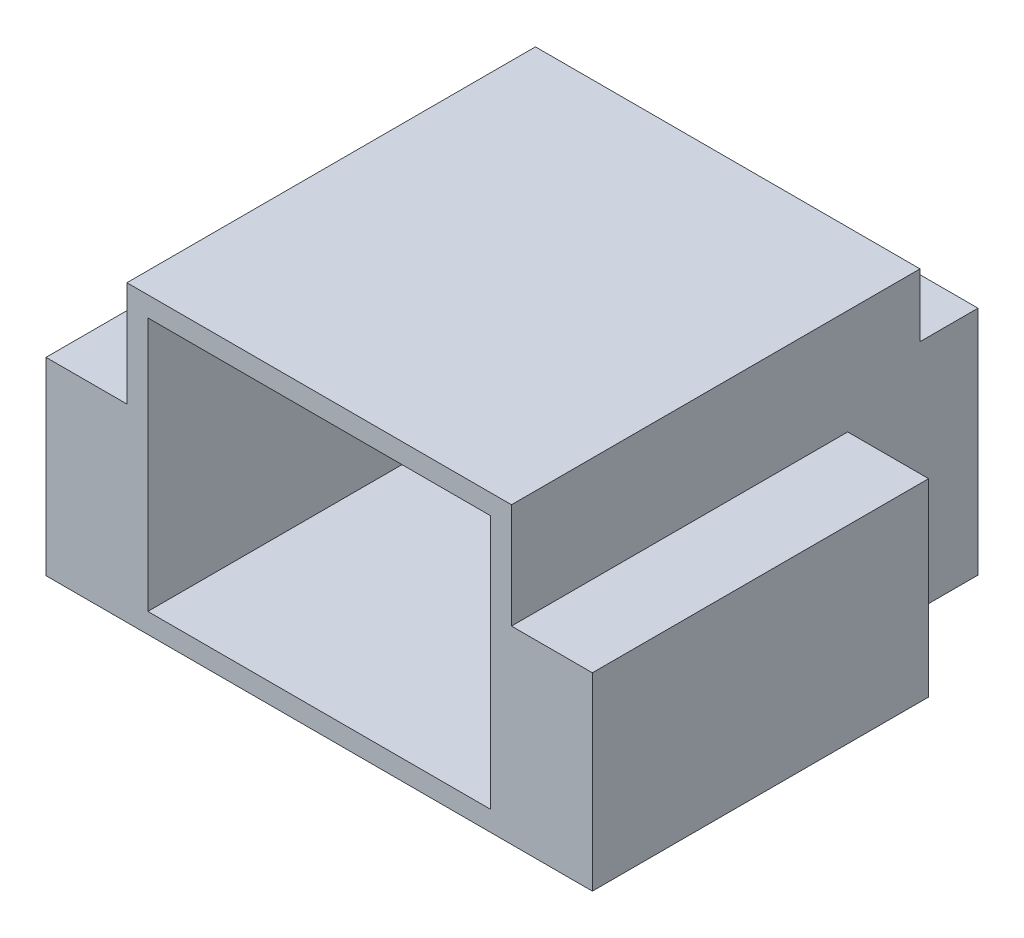
ISO-10303-21;
HEADER;
FILE_DESCRIPTION(('STEP AP214'),'2;1');
FILE_NAME('part.step','',(''),(''),'','','');
FILE_SCHEMA(('AUTOMOTIVE_DESIGN { 1 0 10303 214 1 1 1 1 }'));
ENDSEC;
DATA;
#1=APPLICATION_CONTEXT('core data for automotive mechanical design processes');
#2=APPLICATION_PROTOCOL_DEFINITION('international standard','automotive_design',2000,#1);
#3=PRODUCT_CONTEXT('',#1,'mechanical');
#4=PRODUCT('Part','Part','',(#3));
#5=PRODUCT_RELATED_PRODUCT_CATEGORY('part','',(#4));
#6=PRODUCT_DEFINITION_FORMATION('','',#4);
#7=PRODUCT_DEFINITION_CONTEXT('part definition',#1,'design');
#8=PRODUCT_DEFINITION('design','',#6,#7);
#9=PRODUCT_DEFINITION_SHAPE('','',#8);
#10=(LENGTH_UNIT() NAMED_UNIT(*) SI_UNIT(.MILLI.,.METRE.));
#11=(NAMED_UNIT(*) PLANE_ANGLE_UNIT() SI_UNIT($,.RADIAN.));
#12=(NAMED_UNIT(*) SI_UNIT($,.STERADIAN.) SOLID_ANGLE_UNIT());
#13=UNCERTAINTY_MEASURE_WITH_UNIT(LENGTH_MEASURE(1.E-05),#10,'distance_accuracy_value','');
#14=(GEOMETRIC_REPRESENTATION_CONTEXT(3) GLOBAL_UNCERTAINTY_ASSIGNED_CONTEXT((#13)) GLOBAL_UNIT_ASSIGNED_CONTEXT((#10,
#11,#12)) REPRESENTATION_CONTEXT('',''));
#15=CARTESIAN_POINT('',(0.,0.,0.));
#16=DIRECTION('',(0.,0.,1.));
#17=DIRECTION('',(1.,0.,0.));
#18=AXIS2_PLACEMENT_3D('',#15,#16,#17);
#19=CARTESIAN_POINT('',(0.,7.,-7.1));
#20=DIRECTION('',(0.,0.,-1.));
#21=DIRECTION('',(-1.,0.,0.));
#22=AXIS2_PLACEMENT_3D('',#19,#20,#21);
#23=PLANE('',#22);
#24=DIRECTION('',(0.,-1.,0.));
#25=VECTOR('',#24,1.);
#26=CARTESIAN_POINT('',(-4.575,7.,-7.1));
#27=LINE('',#26,#25);
#28=CARTESIAN_POINT('',(-4.575,5.5,-7.1));
#29=VERTEX_POINT('',#28);
#30=CARTESIAN_POINT('',(-4.575,0.,-7.1));
#31=VERTEX_POINT('',#30);
#32=EDGE_CURVE('E238',#29,#31,#27,.T.);
#33=ORIENTED_EDGE('',*,*,#32,.F.);
#34=DIRECTION('',(-1.,0.,0.));
#35=VECTOR('',#34,1.);
#36=CARTESIAN_POINT('',(-4.575,5.5,-7.1));
#37=LINE('',#36,#35);
#38=CARTESIAN_POINT('',(4.575,5.5,-7.1));
#39=VERTEX_POINT('',#38);
#40=EDGE_CURVE('E195',#39,#29,#37,.T.);
#41=ORIENTED_EDGE('',*,*,#40,.F.);
#42=DIRECTION('',(0.,-1.,0.));
#43=VECTOR('',#42,1.);
#44=CARTESIAN_POINT('',(4.575,7.,-7.1));
#45=LINE('',#44,#43);
#46=CARTESIAN_POINT('',(4.575,0.,-7.1));
#47=VERTEX_POINT('',#46);
#48=EDGE_CURVE('E260',#39,#47,#45,.T.);
#49=ORIENTED_EDGE('',*,*,#48,.T.);
#50=DIRECTION('',(1.,0.,0.));
#51=VECTOR('',#50,1.);
#52=CARTESIAN_POINT('',(0.,0.,-7.1));
#53=LINE('',#52,#51);
#54=EDGE_CURVE('E232',#31,#47,#53,.T.);
#55=ORIENTED_EDGE('',*,*,#54,.F.);
#56=EDGE_LOOP('',(#33,#41,#49,#55));
#57=FACE_BOUND('',#56,.T.);
#58=ADVANCED_FACE('F37',(#57),#23,.T.);
#59=CARTESIAN_POINT('',(6.5,7.,0.));
#60=DIRECTION('',(-1.,0.,0.));
#61=DIRECTION('',(0.,0.,1.));
#62=AXIS2_PLACEMENT_3D('',#59,#60,#61);
#63=PLANE('',#62);
#64=DIRECTION('',(0.,0.,-1.));
#65=VECTOR('',#64,1.);
#66=CARTESIAN_POINT('',(6.5,4.5,-4.));
#67=LINE('',#66,#65);
#68=CARTESIAN_POINT('',(6.5,4.5,4.));
#69=VERTEX_POINT('',#68);
#70=CARTESIAN_POINT('',(6.5,4.5,-4.));
#71=VERTEX_POINT('',#70);
#72=EDGE_CURVE('E221',#69,#71,#67,.T.);
#73=ORIENTED_EDGE('',*,*,#72,.F.);
#74=DIRECTION('',(0.,-1.,0.));
#75=VECTOR('',#74,1.);
#76=CARTESIAN_POINT('',(6.5,7.,4.));
#77=LINE('',#76,#75);
#78=CARTESIAN_POINT('',(6.5,0.,4.));
#79=VERTEX_POINT('',#78);
#80=EDGE_CURVE('E266',#69,#79,#77,.T.);
#81=ORIENTED_EDGE('',*,*,#80,.T.);
#82=DIRECTION('',(0.,0.,-1.));
#83=VECTOR('',#82,1.);
#84=CARTESIAN_POINT('',(6.5,0.,0.));
#85=LINE('',#84,#83);
#86=CARTESIAN_POINT('',(6.5,0.,-4.));
#87=VERTEX_POINT('',#86);
#88=EDGE_CURVE('E251',#79,#87,#85,.T.);
#89=ORIENTED_EDGE('',*,*,#88,.T.);
#90=DIRECTION('',(0.,-1.,0.));
#91=VECTOR('',#90,1.);
#92=CARTESIAN_POINT('',(6.5,7.,-4.));
#93=LINE('',#92,#91);
#94=EDGE_CURVE('E264',#71,#87,#93,.T.);
#95=ORIENTED_EDGE('',*,*,#94,.F.);
#96=EDGE_LOOP('',(#73,#81,#89,#95));
#97=FACE_BOUND('',#96,.T.);
#98=ADVANCED_FACE('F314',(#97),#63,.F.);
#99=CARTESIAN_POINT('',(0.,7.,-4.));
#100=DIRECTION('',(0.,0.,-1.));
#101=DIRECTION('',(-1.,0.,0.));
#102=AXIS2_PLACEMENT_3D('',#99,#100,#101);
#103=PLANE('',#102);
#104=DIRECTION('',(0.,-1.,0.));
#105=VECTOR('',#104,1.);
#106=CARTESIAN_POINT('',(4.575,7.,-4.));
#107=LINE('',#106,#105);
#108=CARTESIAN_POINT('',(4.575,4.5,-4.));
#109=VERTEX_POINT('',#108);
#110=CARTESIAN_POINT('',(4.575,0.,-4.));
#111=VERTEX_POINT('',#110);
#112=EDGE_CURVE('E262',#109,#111,#107,.T.);
#113=ORIENTED_EDGE('',*,*,#112,.F.);
#114=DIRECTION('',(-1.,0.,0.));
#115=VECTOR('',#114,1.);
#116=CARTESIAN_POINT('',(4.575,4.5,-4.));
#117=LINE('',#116,#115);
#118=EDGE_CURVE('E223',#71,#109,#117,.T.);
#119=ORIENTED_EDGE('',*,*,#118,.F.);
#120=ORIENTED_EDGE('',*,*,#94,.T.);
#121=DIRECTION('',(1.,0.,0.));
#122=VECTOR('',#121,1.);
#123=CARTESIAN_POINT('',(0.,0.,-4.));
#124=LINE('',#123,#122);
#125=EDGE_CURVE('E245',#111,#87,#124,.T.);
#126=ORIENTED_EDGE('',*,*,#125,.F.);
#127=EDGE_LOOP('',(#113,#119,#120,#126));
#128=FACE_BOUND('',#127,.T.);
#129=ADVANCED_FACE('F309',(#128),#103,.T.);
#130=CARTESIAN_POINT('',(-4.575,7.,0.));
#131=DIRECTION('',(-1.,0.,0.));
#132=DIRECTION('',(0.,0.,1.));
#133=AXIS2_PLACEMENT_3D('',#130,#131,#132);
#134=PLANE('',#133);
#135=DIRECTION('',(0.,1.,0.));
#136=VECTOR('',#135,1.);
#137=CARTESIAN_POINT('',(-4.575,5.5,-5.72056539600396));
#138=LINE('',#137,#136);
#139=CARTESIAN_POINT('',(-4.575,5.5,-5.72056539600396));
#140=VERTEX_POINT('',#139);
#141=CARTESIAN_POINT('',(-4.575,7.,-5.72056539600396));
#142=VERTEX_POINT('',#141);
#143=EDGE_CURVE('E60',#140,#142,#138,.T.);
#144=ORIENTED_EDGE('',*,*,#143,.F.);
#145=DIRECTION('',(0.,0.,1.));
#146=VECTOR('',#145,1.);
#147=CARTESIAN_POINT('',(-4.575,5.5,-7.1));
#148=LINE('',#147,#146);
#149=EDGE_CURVE('E187',#29,#140,#148,.T.);
#150=ORIENTED_EDGE('',*,*,#149,.F.);
#151=ORIENTED_EDGE('',*,*,#32,.T.);
#152=DIRECTION('',(0.,0.,-1.));
#153=VECTOR('',#152,1.);
#154=CARTESIAN_POINT('',(-4.575,0.,0.));
#155=LINE('',#154,#153);
#156=CARTESIAN_POINT('',(-4.575,0.,-4.));
#157=VERTEX_POINT('',#156);
#158=EDGE_CURVE('E216',#157,#31,#155,.T.);
#159=ORIENTED_EDGE('',*,*,#158,.F.);
#160=DIRECTION('',(0.,-1.,0.));
#161=VECTOR('',#160,1.);
#162=CARTESIAN_POINT('',(-4.575,7.,-4.));
#163=LINE('',#162,#161);
#164=CARTESIAN_POINT('',(-4.575,4.5,-4.));
#165=VERTEX_POINT('',#164);
#166=EDGE_CURVE('E11',#165,#157,#163,.T.);
#167=ORIENTED_EDGE('',*,*,#166,.F.);
#168=DIRECTION('',(0.,0.,-1.));
#169=VECTOR('',#168,1.);
#170=CARTESIAN_POINT('',(-4.575,4.5,-4.));
#171=LINE('',#170,#169);
#172=CARTESIAN_POINT('',(-4.575,4.5,4.));
#173=VERTEX_POINT('',#172);
#174=EDGE_CURVE('E203',#173,#165,#171,.T.);
#175=ORIENTED_EDGE('',*,*,#174,.F.);
#176=DIRECTION('',(0.,1.,0.));
#177=VECTOR('',#176,1.);
#178=CARTESIAN_POINT('',(-4.575,4.5,4.));
#179=LINE('',#178,#177);
#180=CARTESIAN_POINT('',(-4.575,7.,4.));
#181=VERTEX_POINT('',#180);
#182=EDGE_CURVE('E213',#173,#181,#179,.T.);
#183=ORIENTED_EDGE('',*,*,#182,.T.);
#184=DIRECTION('',(0.,0.,-1.));
#185=VECTOR('',#184,1.);
#186=CARTESIAN_POINT('',(-4.575,7.,0.));
#187=LINE('',#186,#185);
#188=EDGE_CURVE('E228',#181,#142,#187,.T.);
#189=ORIENTED_EDGE('',*,*,#188,.T.);
#190=EDGE_LOOP('',(#144,#150,#151,#159,#167,#175,#183,#189));
#191=FACE_BOUND('',#190,.T.);
#192=ADVANCED_FACE('F39',(#191),#134,.T.);
#193=DIRECTION('',(-1.,0.,0.));
#194=VECTOR('',#193,1.);
#195=CARTESIAN_POINT('',(-4.575,4.5,-4.));
#196=LINE('',#195,#194);
#197=CARTESIAN_POINT('',(-6.5,4.5,-4.));
#198=VERTEX_POINT('',#197);
#199=EDGE_CURVE('E205',#165,#198,#196,.T.);
#200=ORIENTED_EDGE('',*,*,#199,.F.);
#201=ORIENTED_EDGE('',*,*,#166,.T.);
#202=CARTESIAN_POINT('',(-6.5,0.,-4.));
#203=VERTEX_POINT('',#202);
#204=EDGE_CURVE('E241',#203,#157,#124,.T.);
#205=ORIENTED_EDGE('',*,*,#204,.F.);
#206=DIRECTION('',(0.,-1.,0.));
#207=VECTOR('',#206,1.);
#208=CARTESIAN_POINT('',(-6.5,7.,-4.));
#209=LINE('',#208,#207);
#210=EDGE_CURVE('E45',#198,#203,#209,.T.);
#211=ORIENTED_EDGE('',*,*,#210,.F.);
#212=EDGE_LOOP('',(#200,#201,#205,#211));
#213=FACE_BOUND('',#212,.T.);
#214=ADVANCED_FACE('F278',(#213),#103,.T.);
#215=CARTESIAN_POINT('',(-6.5,7.,0.));
#216=DIRECTION('',(-1.,0.,0.));
#217=DIRECTION('',(0.,0.,1.));
#218=AXIS2_PLACEMENT_3D('',#215,#216,#217);
#219=PLANE('',#218);
#220=DIRECTION('',(0.,0.,1.));
#221=VECTOR('',#220,1.);
#222=CARTESIAN_POINT('',(-6.5,4.5,-4.));
#223=LINE('',#222,#221);
#224=CARTESIAN_POINT('',(-6.5,4.5,4.));
#225=VERTEX_POINT('',#224);
#226=EDGE_CURVE('E208',#198,#225,#223,.T.);
#227=ORIENTED_EDGE('',*,*,#226,.F.);
#228=ORIENTED_EDGE('',*,*,#210,.T.);
#229=DIRECTION('',(0.,0.,-1.));
#230=VECTOR('',#229,1.);
#231=CARTESIAN_POINT('',(-6.5,0.,0.));
#232=LINE('',#231,#230);
#233=CARTESIAN_POINT('',(-6.5,0.,4.));
#234=VERTEX_POINT('',#233);
#235=EDGE_CURVE('E244',#234,#203,#232,.T.);
#236=ORIENTED_EDGE('',*,*,#235,.F.);
#237=DIRECTION('',(0.,-1.,0.));
#238=VECTOR('',#237,1.);
#239=CARTESIAN_POINT('',(-6.5,7.,4.));
#240=LINE('',#239,#238);
#241=EDGE_CURVE('E268',#225,#234,#240,.T.);
#242=ORIENTED_EDGE('',*,*,#241,.F.);
#243=EDGE_LOOP('',(#227,#228,#236,#242));
#244=FACE_BOUND('',#243,.T.);
#245=ADVANCED_FACE('F274',(#244),#219,.T.);
#246=CARTESIAN_POINT('',(0.,7.,4.));
#247=DIRECTION('',(0.,0.,-1.));
#248=DIRECTION('',(-1.,0.,0.));
#249=AXIS2_PLACEMENT_3D('',#246,#247,#248);
#250=PLANE('',#249);
#251=DIRECTION('',(0.,1.,0.));
#252=VECTOR('',#251,1.);
#253=CARTESIAN_POINT('',(4.07761296072096,0.,4.));
#254=LINE('',#253,#252);
#255=CARTESIAN_POINT('',(4.07761296072096,0.475574495931823,4.));
#256=VERTEX_POINT('',#255);
#257=CARTESIAN_POINT('',(4.07761296072096,6.52442550406818,4.));
#258=VERTEX_POINT('',#257);
#259=EDGE_CURVE('E177',#256,#258,#254,.T.);
#260=ORIENTED_EDGE('',*,*,#259,.F.);
#261=DIRECTION('',(1.,0.,0.));
#262=VECTOR('',#261,1.);
#263=CARTESIAN_POINT('',(0.,0.475574495931823,4.));
#264=LINE('',#263,#262);
#265=CARTESIAN_POINT('',(-4.07761296072096,0.475574495931823,4.));
#266=VERTEX_POINT('',#265);
#267=EDGE_CURVE('E52',#266,#256,#264,.T.);
#268=ORIENTED_EDGE('',*,*,#267,.F.);
#269=DIRECTION('',(0.,1.,0.));
#270=VECTOR('',#269,1.);
#271=CARTESIAN_POINT('',(-4.07761296072096,0.,4.));
#272=LINE('',#271,#270);
#273=CARTESIAN_POINT('',(-4.07761296072096,6.52442550406818,4.));
#274=VERTEX_POINT('',#273);
#275=EDGE_CURVE('E168',#266,#274,#272,.T.);
#276=ORIENTED_EDGE('',*,*,#275,.T.);
#277=DIRECTION('',(1.,0.,0.));
#278=VECTOR('',#277,1.);
#279=CARTESIAN_POINT('',(0.,6.52442550406818,4.));
#280=LINE('',#279,#278);
#281=EDGE_CURVE('E171',#274,#258,#280,.T.);
#282=ORIENTED_EDGE('',*,*,#281,.T.);
#283=EDGE_LOOP('',(#260,#268,#276,#282));
#284=FACE_BOUND('',#283,.T.);
#285=DIRECTION('',(1.,0.,0.));
#286=VECTOR('',#285,1.);
#287=CARTESIAN_POINT('',(0.,7.,4.));
#288=LINE('',#287,#286);
#289=CARTESIAN_POINT('',(4.575,7.,4.));
#290=VERTEX_POINT('',#289);
#291=EDGE_CURVE('E231',#181,#290,#288,.T.);
#292=ORIENTED_EDGE('',*,*,#291,.F.);
#293=ORIENTED_EDGE('',*,*,#182,.F.);
#294=DIRECTION('',(1.,0.,0.));
#295=VECTOR('',#294,1.);
#296=CARTESIAN_POINT('',(-4.575,4.5,4.));
#297=LINE('',#296,#295);
#298=EDGE_CURVE('E210',#225,#173,#297,.T.);
#299=ORIENTED_EDGE('',*,*,#298,.F.);
#300=ORIENTED_EDGE('',*,*,#241,.T.);
#301=DIRECTION('',(1.,0.,0.));
#302=VECTOR('',#301,1.);
#303=CARTESIAN_POINT('',(0.,0.,4.));
#304=LINE('',#303,#302);
#305=EDGE_CURVE('E248',#234,#79,#304,.T.);
#306=ORIENTED_EDGE('',*,*,#305,.T.);
#307=ORIENTED_EDGE('',*,*,#80,.F.);
#308=DIRECTION('',(1.,0.,0.));
#309=VECTOR('',#308,1.);
#310=CARTESIAN_POINT('',(4.575,4.5,4.));
#311=LINE('',#310,#309);
#312=CARTESIAN_POINT('',(4.575,4.5,4.));
#313=VERTEX_POINT('',#312);
#314=EDGE_CURVE('E219',#313,#69,#311,.T.);
#315=ORIENTED_EDGE('',*,*,#314,.F.);
#316=DIRECTION('',(0.,1.,0.));
#317=VECTOR('',#316,1.);
#318=CARTESIAN_POINT('',(4.575,4.5,4.));
#319=LINE('',#318,#317);
#320=EDGE_CURVE('E206',#313,#290,#319,.T.);
#321=ORIENTED_EDGE('',*,*,#320,.T.);
#322=EDGE_LOOP('',(#292,#293,#299,#300,#306,#307,#315,#321));
#323=FACE_BOUND('',#322,.T.);
#324=ADVANCED_FACE('F289',(#284,#323),#250,.F.);
#325=CARTESIAN_POINT('',(4.575,7.,0.));
#326=DIRECTION('',(-1.,0.,0.));
#327=DIRECTION('',(0.,0.,1.));
#328=AXIS2_PLACEMENT_3D('',#325,#326,#327);
#329=PLANE('',#328);
#330=DIRECTION('',(0.,0.,-1.));
#331=VECTOR('',#330,1.);
#332=CARTESIAN_POINT('',(4.575,5.5,-7.1));
#333=LINE('',#332,#331);
#334=CARTESIAN_POINT('',(4.575,5.5,-5.72056539600396));
#335=VERTEX_POINT('',#334);
#336=EDGE_CURVE('E193',#335,#39,#333,.T.);
#337=ORIENTED_EDGE('',*,*,#336,.F.);
#338=DIRECTION('',(0.,1.,0.));
#339=VECTOR('',#338,1.);
#340=CARTESIAN_POINT('',(4.575,5.5,-5.72056539600396));
#341=LINE('',#340,#339);
#342=CARTESIAN_POINT('',(4.575,7.,-5.72056539600396));
#343=VERTEX_POINT('',#342);
#344=EDGE_CURVE('E198',#335,#343,#341,.T.);
#345=ORIENTED_EDGE('',*,*,#344,.T.);
#346=DIRECTION('',(0.,0.,-1.));
#347=VECTOR('',#346,1.);
#348=CARTESIAN_POINT('',(4.575,7.,0.));
#349=LINE('',#348,#347);
#350=EDGE_CURVE('E235',#290,#343,#349,.T.);
#351=ORIENTED_EDGE('',*,*,#350,.F.);
#352=ORIENTED_EDGE('',*,*,#320,.F.);
#353=DIRECTION('',(0.,0.,1.));
#354=VECTOR('',#353,1.);
#355=CARTESIAN_POINT('',(4.575,4.5,-4.));
#356=LINE('',#355,#354);
#357=EDGE_CURVE('E201',#109,#313,#356,.T.);
#358=ORIENTED_EDGE('',*,*,#357,.F.);
#359=ORIENTED_EDGE('',*,*,#112,.T.);
#360=DIRECTION('',(0.,0.,-1.));
#361=VECTOR('',#360,1.);
#362=CARTESIAN_POINT('',(4.575,0.,0.));
#363=LINE('',#362,#361);
#364=EDGE_CURVE('E254',#111,#47,#363,.T.);
#365=ORIENTED_EDGE('',*,*,#364,.T.);
#366=ORIENTED_EDGE('',*,*,#48,.F.);
#367=EDGE_LOOP('',(#337,#345,#351,#352,#358,#359,#365,#366));
#368=FACE_BOUND('',#367,.T.);
#369=ADVANCED_FACE('F305',(#368),#329,.F.);
#370=CARTESIAN_POINT('',(0.,7.,0.));
#371=DIRECTION('',(0.,1.,0.));
#372=DIRECTION('',(0.,0.,1.));
#373=AXIS2_PLACEMENT_3D('',#370,#371,#372);
#374=PLANE('',#373);
#375=DIRECTION('',(1.,0.,0.));
#376=VECTOR('',#375,1.);
#377=CARTESIAN_POINT('',(-4.575,7.,-5.72056539600396));
#378=LINE('',#377,#376);
#379=EDGE_CURVE('E183',#142,#343,#378,.T.);
#380=ORIENTED_EDGE('',*,*,#379,.F.);
#381=ORIENTED_EDGE('',*,*,#188,.F.);
#382=ORIENTED_EDGE('',*,*,#291,.T.);
#383=ORIENTED_EDGE('',*,*,#350,.T.);
#384=EDGE_LOOP('',(#380,#381,#382,#383));
#385=FACE_BOUND('',#384,.T.);
#386=ADVANCED_FACE('F318',(#385),#374,.T.);
#387=CARTESIAN_POINT('',(0.,0.,0.));
#388=DIRECTION('',(0.,1.,0.));
#389=DIRECTION('',(0.,0.,1.));
#390=AXIS2_PLACEMENT_3D('',#387,#388,#389);
#391=PLANE('',#390);
#392=ORIENTED_EDGE('',*,*,#158,.T.);
#393=ORIENTED_EDGE('',*,*,#54,.T.);
#394=ORIENTED_EDGE('',*,*,#364,.F.);
#395=ORIENTED_EDGE('',*,*,#125,.T.);
#396=ORIENTED_EDGE('',*,*,#88,.F.);
#397=ORIENTED_EDGE('',*,*,#305,.F.);
#398=ORIENTED_EDGE('',*,*,#235,.T.);
#399=ORIENTED_EDGE('',*,*,#204,.T.);
#400=EDGE_LOOP('',(#392,#393,#394,#395,#396,#397,#398,#399));
#401=FACE_BOUND('',#400,.T.);
#402=ADVANCED_FACE('F283',(#401),#391,.F.);
#403=CARTESIAN_POINT('',(0.,4.5,0.));
#404=DIRECTION('',(0.,1.,0.));
#405=DIRECTION('',(0.,0.,1.));
#406=AXIS2_PLACEMENT_3D('',#403,#404,#405);
#407=PLANE('',#406);
#408=ORIENTED_EDGE('',*,*,#357,.T.);
#409=ORIENTED_EDGE('',*,*,#314,.T.);
#410=ORIENTED_EDGE('',*,*,#72,.T.);
#411=ORIENTED_EDGE('',*,*,#118,.T.);
#412=EDGE_LOOP('',(#408,#409,#410,#411));
#413=FACE_BOUND('',#412,.T.);
#414=ADVANCED_FACE('F316',(#413),#407,.T.);
#415=CARTESIAN_POINT('',(0.,4.5,0.));
#416=DIRECTION('',(0.,-1.,0.));
#417=DIRECTION('',(0.,0.,-1.));
#418=AXIS2_PLACEMENT_3D('',#415,#416,#417);
#419=PLANE('',#418);
#420=ORIENTED_EDGE('',*,*,#174,.T.);
#421=ORIENTED_EDGE('',*,*,#199,.T.);
#422=ORIENTED_EDGE('',*,*,#226,.T.);
#423=ORIENTED_EDGE('',*,*,#298,.T.);
#424=EDGE_LOOP('',(#420,#421,#422,#423));
#425=FACE_BOUND('',#424,.T.);
#426=ADVANCED_FACE('F294',(#425),#419,.F.);
#427=CARTESIAN_POINT('',(-4.575,5.5,-5.72056539600396));
#428=DIRECTION('',(0.,0.,1.));
#429=DIRECTION('',(1.,0.,0.));
#430=AXIS2_PLACEMENT_3D('',#427,#428,#429);
#431=PLANE('',#430);
#432=ORIENTED_EDGE('',*,*,#379,.T.);
#433=ORIENTED_EDGE('',*,*,#344,.F.);
#434=DIRECTION('',(1.,0.,0.));
#435=VECTOR('',#434,1.);
#436=CARTESIAN_POINT('',(-4.575,5.5,-5.72056539600396));
#437=LINE('',#436,#435);
#438=EDGE_CURVE('E190',#140,#335,#437,.T.);
#439=ORIENTED_EDGE('',*,*,#438,.F.);
#440=ORIENTED_EDGE('',*,*,#143,.T.);
#441=EDGE_LOOP('',(#432,#433,#439,#440));
#442=FACE_BOUND('',#441,.T.);
#443=ADVANCED_FACE('F321',(#442),#431,.F.);
#444=CARTESIAN_POINT('',(0.,5.5,0.));
#445=DIRECTION('',(0.,1.,0.));
#446=DIRECTION('',(0.,0.,1.));
#447=AXIS2_PLACEMENT_3D('',#444,#445,#446);
#448=PLANE('',#447);
#449=ORIENTED_EDGE('',*,*,#149,.T.);
#450=ORIENTED_EDGE('',*,*,#438,.T.);
#451=ORIENTED_EDGE('',*,*,#336,.T.);
#452=ORIENTED_EDGE('',*,*,#40,.T.);
#453=EDGE_LOOP('',(#449,#450,#451,#452));
#454=FACE_BOUND('',#453,.T.);
#455=ADVANCED_FACE('F320',(#454),#448,.T.);
#456=CARTESIAN_POINT('',(0.,0.475574495931823,-4.));
#457=DIRECTION('',(0.,-1.,0.));
#458=DIRECTION('',(0.,0.,-1.));
#459=AXIS2_PLACEMENT_3D('',#456,#457,#458);
#460=PLANE('',#459);
#461=ORIENTED_EDGE('',*,*,#267,.T.);
#462=DIRECTION('',(0.,0.,1.));
#463=VECTOR('',#462,1.);
#464=CARTESIAN_POINT('',(4.07761296072096,0.475574495931823,-4.));
#465=LINE('',#464,#463);
#466=CARTESIAN_POINT('',(4.07761296072096,0.475574495931823,-4.));
#467=VERTEX_POINT('',#466);
#468=EDGE_CURVE('E147',#467,#256,#465,.T.);
#469=ORIENTED_EDGE('',*,*,#468,.F.);
#470=DIRECTION('',(1.,0.,0.));
#471=VECTOR('',#470,1.);
#472=CARTESIAN_POINT('',(0.,0.475574495931823,-4.));
#473=LINE('',#472,#471);
#474=CARTESIAN_POINT('',(-4.07761296072096,0.475574495931823,-4.));
#475=VERTEX_POINT('',#474);
#476=EDGE_CURVE('E151',#475,#467,#473,.T.);
#477=ORIENTED_EDGE('',*,*,#476,.F.);
#478=DIRECTION('',(0.,0.,1.));
#479=VECTOR('',#478,1.);
#480=CARTESIAN_POINT('',(-4.07761296072096,0.475574495931823,-4.));
#481=LINE('',#480,#479);
#482=EDGE_CURVE('E181',#475,#266,#481,.T.);
#483=ORIENTED_EDGE('',*,*,#482,.T.);
#484=EDGE_LOOP('',(#461,#469,#477,#483));
#485=FACE_BOUND('',#484,.T.);
#486=ADVANCED_FACE('F149',(#485),#460,.F.);
#487=CARTESIAN_POINT('',(-4.07761296072096,0.,-4.));
#488=DIRECTION('',(1.,0.,0.));
#489=DIRECTION('',(0.,0.,-1.));
#490=AXIS2_PLACEMENT_3D('',#487,#488,#489);
#491=PLANE('',#490);
#492=ORIENTED_EDGE('',*,*,#275,.F.);
#493=ORIENTED_EDGE('',*,*,#482,.F.);
#494=DIRECTION('',(0.,1.,0.));
#495=VECTOR('',#494,1.);
#496=CARTESIAN_POINT('',(-4.07761296072096,0.,-4.));
#497=LINE('',#496,#495);
#498=CARTESIAN_POINT('',(-4.07761296072096,6.52442550406818,-4.));
#499=VERTEX_POINT('',#498);
#500=EDGE_CURVE('E156',#475,#499,#497,.T.);
#501=ORIENTED_EDGE('',*,*,#500,.T.);
#502=DIRECTION('',(0.,0.,1.));
#503=VECTOR('',#502,1.);
#504=CARTESIAN_POINT('',(-4.07761296072096,6.52442550406818,-4.));
#505=LINE('',#504,#503);
#506=EDGE_CURVE('E184',#499,#274,#505,.T.);
#507=ORIENTED_EDGE('',*,*,#506,.T.);
#508=EDGE_LOOP('',(#492,#493,#501,#507));
#509=FACE_BOUND('',#508,.T.);
#510=ADVANCED_FACE('F411',(#509),#491,.T.);
#511=CARTESIAN_POINT('',(0.,6.52442550406818,-4.));
#512=DIRECTION('',(0.,-1.,0.));
#513=DIRECTION('',(0.,0.,-1.));
#514=AXIS2_PLACEMENT_3D('',#511,#512,#513);
#515=PLANE('',#514);
#516=ORIENTED_EDGE('',*,*,#281,.F.);
#517=ORIENTED_EDGE('',*,*,#506,.F.);
#518=DIRECTION('',(1.,0.,0.));
#519=VECTOR('',#518,1.);
#520=CARTESIAN_POINT('',(0.,6.52442550406818,-4.));
#521=LINE('',#520,#519);
#522=CARTESIAN_POINT('',(4.07761296072096,6.52442550406818,-4.));
#523=VERTEX_POINT('',#522);
#524=EDGE_CURVE('E164',#499,#523,#521,.T.);
#525=ORIENTED_EDGE('',*,*,#524,.T.);
#526=DIRECTION('',(0.,0.,1.));
#527=VECTOR('',#526,1.);
#528=CARTESIAN_POINT('',(4.07761296072096,6.52442550406818,-4.));
#529=LINE('',#528,#527);
#530=EDGE_CURVE('E155',#523,#258,#529,.T.);
#531=ORIENTED_EDGE('',*,*,#530,.T.);
#532=EDGE_LOOP('',(#516,#517,#525,#531));
#533=FACE_BOUND('',#532,.T.);
#534=ADVANCED_FACE('F419',(#533),#515,.T.);
#535=CARTESIAN_POINT('',(4.07761296072096,0.,-4.));
#536=DIRECTION('',(1.,0.,0.));
#537=DIRECTION('',(0.,0.,-1.));
#538=AXIS2_PLACEMENT_3D('',#535,#536,#537);
#539=PLANE('',#538);
#540=ORIENTED_EDGE('',*,*,#259,.T.);
#541=ORIENTED_EDGE('',*,*,#530,.F.);
#542=DIRECTION('',(0.,1.,0.));
#543=VECTOR('',#542,1.);
#544=CARTESIAN_POINT('',(4.07761296072096,0.,-4.));
#545=LINE('',#544,#543);
#546=EDGE_CURVE('E160',#467,#523,#545,.T.);
#547=ORIENTED_EDGE('',*,*,#546,.F.);
#548=ORIENTED_EDGE('',*,*,#468,.T.);
#549=EDGE_LOOP('',(#540,#541,#547,#548));
#550=FACE_BOUND('',#549,.T.);
#551=ADVANCED_FACE('F161',(#550),#539,.F.);
#552=CARTESIAN_POINT('',(0.,0.,-4.));
#553=DIRECTION('',(0.,0.,1.));
#554=DIRECTION('',(1.,0.,0.));
#555=AXIS2_PLACEMENT_3D('',#552,#553,#554);
#556=PLANE('',#555);
#557=ORIENTED_EDGE('',*,*,#476,.T.);
#558=ORIENTED_EDGE('',*,*,#546,.T.);
#559=ORIENTED_EDGE('',*,*,#524,.F.);
#560=ORIENTED_EDGE('',*,*,#500,.F.);
#561=EDGE_LOOP('',(#557,#558,#559,#560));
#562=FACE_BOUND('',#561,.T.);
#563=ADVANCED_FACE('F167',(#562),#556,.T.);
#564=CLOSED_SHELL('',(#58,#98,#129,#192,#214,#245,#324,#369,#386,#402,#414,#426,#443,#455,#486,
#510,#534,#551,#563));
#565=MANIFOLD_SOLID_BREP('B2',#564);
#566=ADVANCED_BREP_SHAPE_REPRESENTATION('',(#18,#565),#14);
#567=SHAPE_DEFINITION_REPRESENTATION(#9,#566);
ENDSEC;
END-ISO-10303-21;
